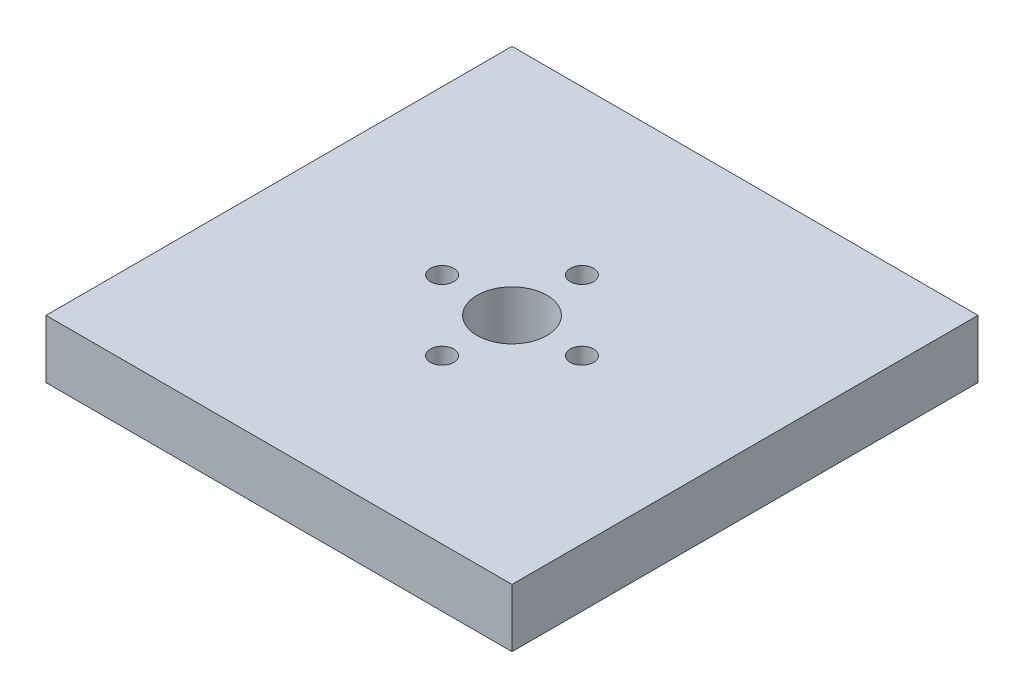
ISO-10303-21;
HEADER;
FILE_DESCRIPTION(('STEP AP214'),'2;1');
FILE_NAME('part.step','',(''),(''),'','','');
FILE_SCHEMA(('AUTOMOTIVE_DESIGN { 1 0 10303 214 1 1 1 1 }'));
ENDSEC;
DATA;
#1=APPLICATION_CONTEXT('core data for automotive mechanical design processes');
#2=APPLICATION_PROTOCOL_DEFINITION('international standard','automotive_design',2000,#1);
#3=PRODUCT_CONTEXT('',#1,'mechanical');
#4=PRODUCT('Part','Part','',(#3));
#5=PRODUCT_RELATED_PRODUCT_CATEGORY('part','',(#4));
#6=PRODUCT_DEFINITION_FORMATION('','',#4);
#7=PRODUCT_DEFINITION_CONTEXT('part definition',#1,'design');
#8=PRODUCT_DEFINITION('design','',#6,#7);
#9=PRODUCT_DEFINITION_SHAPE('','',#8);
#10=(LENGTH_UNIT() NAMED_UNIT(*) SI_UNIT(.MILLI.,.METRE.));
#11=(NAMED_UNIT(*) PLANE_ANGLE_UNIT() SI_UNIT($,.RADIAN.));
#12=(NAMED_UNIT(*) SI_UNIT($,.STERADIAN.) SOLID_ANGLE_UNIT());
#13=UNCERTAINTY_MEASURE_WITH_UNIT(LENGTH_MEASURE(1.E-05),#10,'distance_accuracy_value','');
#14=(GEOMETRIC_REPRESENTATION_CONTEXT(3) GLOBAL_UNCERTAINTY_ASSIGNED_CONTEXT((#13)) GLOBAL_UNIT_ASSIGNED_CONTEXT((#10,
#11,#12)) REPRESENTATION_CONTEXT('',''));
#15=CARTESIAN_POINT('',(0.,0.,0.));
#16=DIRECTION('',(0.,0.,1.));
#17=DIRECTION('',(1.,0.,0.));
#18=AXIS2_PLACEMENT_3D('',#15,#16,#17);
#19=CARTESIAN_POINT('',(0.,5.,0.));
#20=DIRECTION('',(0.,-1.,0.));
#21=DIRECTION('',(0.,0.,-1.));
#22=AXIS2_PLACEMENT_3D('',#19,#20,#21);
#23=PLANE('',#22);
#24=CARTESIAN_POINT('',(14.,5.,-20.));
#25=DIRECTION('',(0.,-1.,0.));
#26=DIRECTION('',(0.,0.,-1.));
#27=AXIS2_PLACEMENT_3D('',#24,#25,#26);
#28=CIRCLE('',#27,0.999999999999998);
#29=CARTESIAN_POINT('',(14.,5.,-21.));
#30=VERTEX_POINT('',#29);
#31=EDGE_CURVE('E119',#30,#30,#28,.F.);
#32=ORIENTED_EDGE('',*,*,#31,.F.);
#33=EDGE_LOOP('',(#32));
#34=FACE_BOUND('',#33,.T.);
#35=CARTESIAN_POINT('',(20.,5.,-14.));
#36=DIRECTION('',(0.,-1.,0.));
#37=DIRECTION('',(0.,0.,-1.));
#38=AXIS2_PLACEMENT_3D('',#35,#36,#37);
#39=CIRCLE('',#38,0.999999999999998);
#40=CARTESIAN_POINT('',(20.,5.,-15.));
#41=VERTEX_POINT('',#40);
#42=EDGE_CURVE('E112',#41,#41,#39,.F.);
#43=ORIENTED_EDGE('',*,*,#42,.F.);
#44=EDGE_LOOP('',(#43));
#45=FACE_BOUND('',#44,.T.);
#46=DIRECTION('',(0.,0.,1.));
#47=VECTOR('',#46,1.);
#48=CARTESIAN_POINT('',(0.,5.,0.));
#49=LINE('',#48,#47);
#50=CARTESIAN_POINT('',(0.,5.,-40.));
#51=VERTEX_POINT('',#50);
#52=CARTESIAN_POINT('',(0.,5.,0.));
#53=VERTEX_POINT('',#52);
#54=EDGE_CURVE('E87',#51,#53,#49,.T.);
#55=ORIENTED_EDGE('',*,*,#54,.T.);
#56=DIRECTION('',(1.,0.,0.));
#57=VECTOR('',#56,1.);
#58=CARTESIAN_POINT('',(0.,5.,0.));
#59=LINE('',#58,#57);
#60=CARTESIAN_POINT('',(40.,5.,0.));
#61=VERTEX_POINT('',#60);
#62=EDGE_CURVE('E82',#53,#61,#59,.T.);
#63=ORIENTED_EDGE('',*,*,#62,.T.);
#64=DIRECTION('',(0.,0.,-1.));
#65=VECTOR('',#64,1.);
#66=CARTESIAN_POINT('',(40.,5.,0.));
#67=LINE('',#66,#65);
#68=CARTESIAN_POINT('',(40.,5.,-40.));
#69=VERTEX_POINT('',#68);
#70=EDGE_CURVE('E85',#61,#69,#67,.T.);
#71=ORIENTED_EDGE('',*,*,#70,.T.);
#72=DIRECTION('',(-1.,0.,0.));
#73=VECTOR('',#72,1.);
#74=CARTESIAN_POINT('',(0.,5.,-40.));
#75=LINE('',#74,#73);
#76=EDGE_CURVE('E52',#69,#51,#75,.T.);
#77=ORIENTED_EDGE('',*,*,#76,.T.);
#78=EDGE_LOOP('',(#55,#63,#71,#77));
#79=FACE_BOUND('',#78,.T.);
#80=CARTESIAN_POINT('',(20.,5.,-20.));
#81=DIRECTION('',(0.,-1.,0.));
#82=DIRECTION('',(0.,0.,-1.));
#83=AXIS2_PLACEMENT_3D('',#80,#81,#82);
#84=CIRCLE('',#83,3.);
#85=CARTESIAN_POINT('',(20.,5.,-23.));
#86=VERTEX_POINT('',#85);
#87=EDGE_CURVE('E103',#86,#86,#84,.F.);
#88=ORIENTED_EDGE('',*,*,#87,.F.);
#89=EDGE_LOOP('',(#88));
#90=FACE_BOUND('',#89,.T.);
#91=CARTESIAN_POINT('',(26.,5.,-20.));
#92=DIRECTION('',(0.,-1.,0.));
#93=DIRECTION('',(0.,0.,-1.));
#94=AXIS2_PLACEMENT_3D('',#91,#92,#93);
#95=CIRCLE('',#94,0.999999999999998);
#96=CARTESIAN_POINT('',(26.,5.,-21.));
#97=VERTEX_POINT('',#96);
#98=EDGE_CURVE('E116',#97,#97,#95,.F.);
#99=ORIENTED_EDGE('',*,*,#98,.F.);
#100=EDGE_LOOP('',(#99));
#101=FACE_BOUND('',#100,.T.);
#102=CARTESIAN_POINT('',(20.,5.,-26.));
#103=DIRECTION('',(0.,-1.,0.));
#104=DIRECTION('',(0.,0.,-1.));
#105=AXIS2_PLACEMENT_3D('',#102,#103,#104);
#106=CIRCLE('',#105,0.999999999999998);
#107=CARTESIAN_POINT('',(20.,5.,-27.));
#108=VERTEX_POINT('',#107);
#109=EDGE_CURVE('E122',#108,#108,#106,.F.);
#110=ORIENTED_EDGE('',*,*,#109,.F.);
#111=EDGE_LOOP('',(#110));
#112=FACE_BOUND('',#111,.T.);
#113=ADVANCED_FACE('F33',(#34,#45,#79,#90,#101,#112),#23,.F.);
#114=CARTESIAN_POINT('',(0.,0.,0.));
#115=DIRECTION('',(0.,-1.,0.));
#116=DIRECTION('',(0.,0.,-1.));
#117=AXIS2_PLACEMENT_3D('',#114,#115,#116);
#118=PLANE('',#117);
#119=CARTESIAN_POINT('',(14.,0.,-20.));
#120=DIRECTION('',(0.,-1.,0.));
#121=DIRECTION('',(0.,0.,-1.));
#122=AXIS2_PLACEMENT_3D('',#119,#120,#121);
#123=CIRCLE('',#122,0.999999999999998);
#124=CARTESIAN_POINT('',(14.,0.,-21.));
#125=VERTEX_POINT('',#124);
#126=EDGE_CURVE('E120',#125,#125,#123,.F.);
#127=ORIENTED_EDGE('',*,*,#126,.T.);
#128=EDGE_LOOP('',(#127));
#129=FACE_BOUND('',#128,.T.);
#130=CARTESIAN_POINT('',(20.,0.,-14.));
#131=DIRECTION('',(0.,-1.,0.));
#132=DIRECTION('',(0.,0.,-1.));
#133=AXIS2_PLACEMENT_3D('',#130,#131,#132);
#134=CIRCLE('',#133,0.999999999999998);
#135=CARTESIAN_POINT('',(20.,0.,-15.));
#136=VERTEX_POINT('',#135);
#137=EDGE_CURVE('E113',#136,#136,#134,.F.);
#138=ORIENTED_EDGE('',*,*,#137,.T.);
#139=EDGE_LOOP('',(#138));
#140=FACE_BOUND('',#139,.T.);
#141=DIRECTION('',(0.,0.,1.));
#142=VECTOR('',#141,1.);
#143=CARTESIAN_POINT('',(0.,0.,0.));
#144=LINE('',#143,#142);
#145=CARTESIAN_POINT('',(0.,0.,-40.));
#146=VERTEX_POINT('',#145);
#147=CARTESIAN_POINT('',(0.,0.,0.));
#148=VERTEX_POINT('',#147);
#149=EDGE_CURVE('E100',#146,#148,#144,.T.);
#150=ORIENTED_EDGE('',*,*,#149,.F.);
#151=DIRECTION('',(-1.,0.,0.));
#152=VECTOR('',#151,1.);
#153=CARTESIAN_POINT('',(0.,0.,-40.));
#154=LINE('',#153,#152);
#155=CARTESIAN_POINT('',(40.,0.,-40.));
#156=VERTEX_POINT('',#155);
#157=EDGE_CURVE('E75',#156,#146,#154,.T.);
#158=ORIENTED_EDGE('',*,*,#157,.F.);
#159=DIRECTION('',(0.,0.,-1.));
#160=VECTOR('',#159,1.);
#161=CARTESIAN_POINT('',(40.,0.,0.));
#162=LINE('',#161,#160);
#163=CARTESIAN_POINT('',(40.,0.,0.));
#164=VERTEX_POINT('',#163);
#165=EDGE_CURVE('E69',#164,#156,#162,.T.);
#166=ORIENTED_EDGE('',*,*,#165,.F.);
#167=DIRECTION('',(1.,0.,0.));
#168=VECTOR('',#167,1.);
#169=CARTESIAN_POINT('',(0.,0.,0.));
#170=LINE('',#169,#168);
#171=EDGE_CURVE('E91',#148,#164,#170,.T.);
#172=ORIENTED_EDGE('',*,*,#171,.F.);
#173=EDGE_LOOP('',(#150,#158,#166,#172));
#174=FACE_BOUND('',#173,.T.);
#175=CARTESIAN_POINT('',(20.,0.,-20.));
#176=DIRECTION('',(0.,-1.,0.));
#177=DIRECTION('',(0.,0.,-1.));
#178=AXIS2_PLACEMENT_3D('',#175,#176,#177);
#179=CIRCLE('',#178,3.);
#180=CARTESIAN_POINT('',(20.,0.,-23.));
#181=VERTEX_POINT('',#180);
#182=EDGE_CURVE('E109',#181,#181,#179,.F.);
#183=ORIENTED_EDGE('',*,*,#182,.T.);
#184=EDGE_LOOP('',(#183));
#185=FACE_BOUND('',#184,.T.);
#186=CARTESIAN_POINT('',(26.,0.,-20.));
#187=DIRECTION('',(0.,-1.,0.));
#188=DIRECTION('',(0.,0.,-1.));
#189=AXIS2_PLACEMENT_3D('',#186,#187,#188);
#190=CIRCLE('',#189,0.999999999999998);
#191=CARTESIAN_POINT('',(26.,0.,-21.));
#192=VERTEX_POINT('',#191);
#193=EDGE_CURVE('E117',#192,#192,#190,.F.);
#194=ORIENTED_EDGE('',*,*,#193,.T.);
#195=EDGE_LOOP('',(#194));
#196=FACE_BOUND('',#195,.T.);
#197=CARTESIAN_POINT('',(20.,0.,-26.));
#198=DIRECTION('',(0.,-1.,0.));
#199=DIRECTION('',(0.,0.,-1.));
#200=AXIS2_PLACEMENT_3D('',#197,#198,#199);
#201=CIRCLE('',#200,0.999999999999998);
#202=CARTESIAN_POINT('',(20.,0.,-27.));
#203=VERTEX_POINT('',#202);
#204=EDGE_CURVE('E37',#203,#203,#201,.F.);
#205=ORIENTED_EDGE('',*,*,#204,.T.);
#206=EDGE_LOOP('',(#205));
#207=FACE_BOUND('',#206,.T.);
#208=ADVANCED_FACE('F143',(#129,#140,#174,#185,#196,#207),#118,.T.);
#209=CARTESIAN_POINT('',(0.,5.,0.));
#210=DIRECTION('',(1.,0.,0.));
#211=DIRECTION('',(0.,0.,-1.));
#212=AXIS2_PLACEMENT_3D('',#209,#210,#211);
#213=PLANE('',#212);
#214=ORIENTED_EDGE('',*,*,#149,.T.);
#215=DIRECTION('',(0.,-1.,0.));
#216=VECTOR('',#215,1.);
#217=CARTESIAN_POINT('',(0.,5.,0.));
#218=LINE('',#217,#216);
#219=EDGE_CURVE('E11',#53,#148,#218,.T.);
#220=ORIENTED_EDGE('',*,*,#219,.F.);
#221=ORIENTED_EDGE('',*,*,#54,.F.);
#222=DIRECTION('',(0.,-1.,0.));
#223=VECTOR('',#222,1.);
#224=CARTESIAN_POINT('',(0.,5.,-40.));
#225=LINE('',#224,#223);
#226=EDGE_CURVE('E96',#51,#146,#225,.T.);
#227=ORIENTED_EDGE('',*,*,#226,.T.);
#228=EDGE_LOOP('',(#214,#220,#221,#227));
#229=FACE_BOUND('',#228,.T.);
#230=ADVANCED_FACE('F35',(#229),#213,.F.);
#231=CARTESIAN_POINT('',(0.,5.,0.));
#232=DIRECTION('',(0.,0.,-1.));
#233=DIRECTION('',(-1.,0.,0.));
#234=AXIS2_PLACEMENT_3D('',#231,#232,#233);
#235=PLANE('',#234);
#236=ORIENTED_EDGE('',*,*,#171,.T.);
#237=DIRECTION('',(0.,-1.,0.));
#238=VECTOR('',#237,1.);
#239=CARTESIAN_POINT('',(40.,5.,0.));
#240=LINE('',#239,#238);
#241=EDGE_CURVE('E43',#61,#164,#240,.T.);
#242=ORIENTED_EDGE('',*,*,#241,.F.);
#243=ORIENTED_EDGE('',*,*,#62,.F.);
#244=ORIENTED_EDGE('',*,*,#219,.T.);
#245=EDGE_LOOP('',(#236,#242,#243,#244));
#246=FACE_BOUND('',#245,.T.);
#247=ADVANCED_FACE('F90',(#246),#235,.F.);
#248=CARTESIAN_POINT('',(40.,5.,0.));
#249=DIRECTION('',(-1.,0.,0.));
#250=DIRECTION('',(0.,0.,1.));
#251=AXIS2_PLACEMENT_3D('',#248,#249,#250);
#252=PLANE('',#251);
#253=ORIENTED_EDGE('',*,*,#165,.T.);
#254=DIRECTION('',(0.,-1.,0.));
#255=VECTOR('',#254,1.);
#256=CARTESIAN_POINT('',(40.,5.,-40.));
#257=LINE('',#256,#255);
#258=EDGE_CURVE('E92',#69,#156,#257,.T.);
#259=ORIENTED_EDGE('',*,*,#258,.F.);
#260=ORIENTED_EDGE('',*,*,#70,.F.);
#261=ORIENTED_EDGE('',*,*,#241,.T.);
#262=EDGE_LOOP('',(#253,#259,#260,#261));
#263=FACE_BOUND('',#262,.T.);
#264=ADVANCED_FACE('F94',(#263),#252,.F.);
#265=CARTESIAN_POINT('',(0.,5.,-40.));
#266=DIRECTION('',(0.,0.,1.));
#267=DIRECTION('',(1.,0.,0.));
#268=AXIS2_PLACEMENT_3D('',#265,#266,#267);
#269=PLANE('',#268);
#270=ORIENTED_EDGE('',*,*,#157,.T.);
#271=ORIENTED_EDGE('',*,*,#226,.F.);
#272=ORIENTED_EDGE('',*,*,#76,.F.);
#273=ORIENTED_EDGE('',*,*,#258,.T.);
#274=EDGE_LOOP('',(#270,#271,#272,#273));
#275=FACE_BOUND('',#274,.T.);
#276=ADVANCED_FACE('F168',(#275),#269,.F.);
#277=CARTESIAN_POINT('',(20.,20.,-20.));
#278=DIRECTION('',(0.,-1.,0.));
#279=DIRECTION('',(0.,0.,-1.));
#280=AXIS2_PLACEMENT_3D('',#277,#278,#279);
#281=CYLINDRICAL_SURFACE('',#280,3.);
#282=ORIENTED_EDGE('',*,*,#182,.F.);
#283=EDGE_LOOP('',(#282));
#284=FACE_BOUND('',#283,.T.);
#285=ORIENTED_EDGE('',*,*,#87,.T.);
#286=EDGE_LOOP('',(#285));
#287=FACE_BOUND('',#286,.T.);
#288=ADVANCED_FACE('F140',(#284,#287),#281,.F.);
#289=CARTESIAN_POINT('',(20.,20.,-14.));
#290=DIRECTION('',(0.,-1.,0.));
#291=DIRECTION('',(0.,0.,-1.));
#292=AXIS2_PLACEMENT_3D('',#289,#290,#291);
#293=CYLINDRICAL_SURFACE('',#292,0.999999999999998);
#294=ORIENTED_EDGE('',*,*,#137,.F.);
#295=EDGE_LOOP('',(#294));
#296=FACE_BOUND('',#295,.T.);
#297=ORIENTED_EDGE('',*,*,#42,.T.);
#298=EDGE_LOOP('',(#297));
#299=FACE_BOUND('',#298,.T.);
#300=ADVANCED_FACE('F152',(#296,#299),#293,.F.);
#301=CARTESIAN_POINT('',(26.,20.,-20.));
#302=DIRECTION('',(0.,-1.,0.));
#303=DIRECTION('',(0.,0.,-1.));
#304=AXIS2_PLACEMENT_3D('',#301,#302,#303);
#305=CYLINDRICAL_SURFACE('',#304,0.999999999999998);
#306=ORIENTED_EDGE('',*,*,#193,.F.);
#307=EDGE_LOOP('',(#306));
#308=FACE_BOUND('',#307,.T.);
#309=ORIENTED_EDGE('',*,*,#98,.T.);
#310=EDGE_LOOP('',(#309));
#311=FACE_BOUND('',#310,.T.);
#312=ADVANCED_FACE('F149',(#308,#311),#305,.F.);
#313=CARTESIAN_POINT('',(14.,20.,-20.));
#314=DIRECTION('',(0.,-1.,0.));
#315=DIRECTION('',(0.,0.,-1.));
#316=AXIS2_PLACEMENT_3D('',#313,#314,#315);
#317=CYLINDRICAL_SURFACE('',#316,0.999999999999998);
#318=ORIENTED_EDGE('',*,*,#126,.F.);
#319=EDGE_LOOP('',(#318));
#320=FACE_BOUND('',#319,.T.);
#321=ORIENTED_EDGE('',*,*,#31,.T.);
#322=EDGE_LOOP('',(#321));
#323=FACE_BOUND('',#322,.T.);
#324=ADVANCED_FACE('F151',(#320,#323),#317,.F.);
#325=CARTESIAN_POINT('',(20.,20.,-26.));
#326=DIRECTION('',(0.,-1.,0.));
#327=DIRECTION('',(0.,0.,-1.));
#328=AXIS2_PLACEMENT_3D('',#325,#326,#327);
#329=CYLINDRICAL_SURFACE('',#328,0.999999999999998);
#330=ORIENTED_EDGE('',*,*,#204,.F.);
#331=EDGE_LOOP('',(#330));
#332=FACE_BOUND('',#331,.T.);
#333=ORIENTED_EDGE('',*,*,#109,.T.);
#334=EDGE_LOOP('',(#333));
#335=FACE_BOUND('',#334,.T.);
#336=ADVANCED_FACE('F159',(#332,#335),#329,.F.);
#337=CLOSED_SHELL('',(#113,#208,#230,#247,#264,#276,#288,#300,#312,#324,#336));
#338=MANIFOLD_SOLID_BREP('B2',#337);
#339=ADVANCED_BREP_SHAPE_REPRESENTATION('',(#18,#338),#14);
#340=SHAPE_DEFINITION_REPRESENTATION(#9,#339);
ENDSEC;
END-ISO-10303-21;
